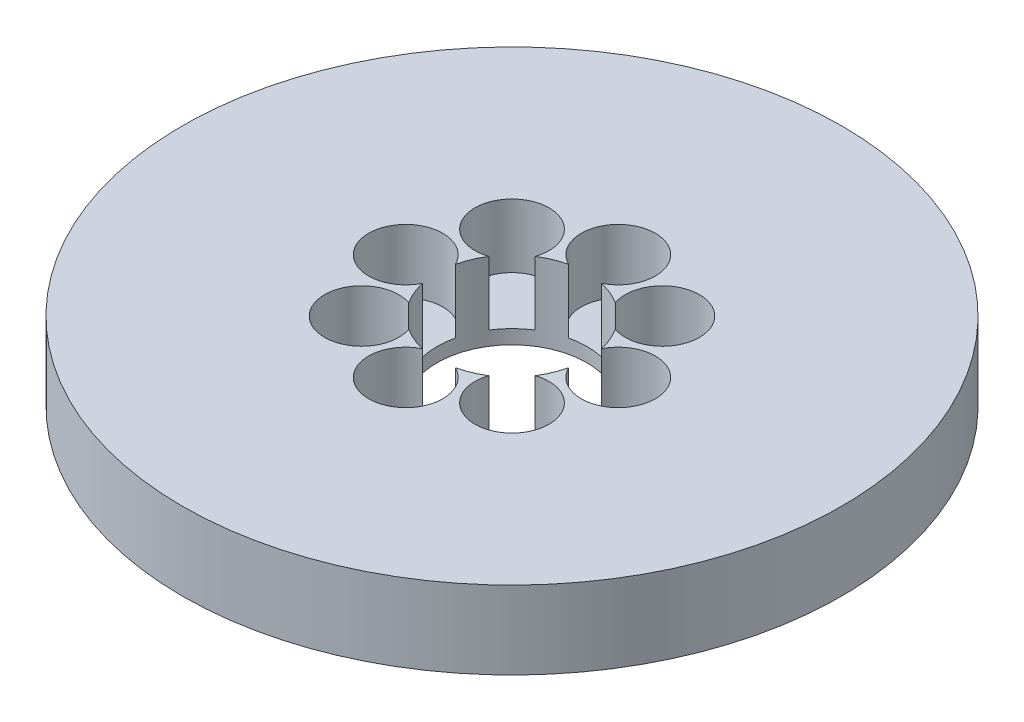
ISO-10303-21;
HEADER;
FILE_DESCRIPTION(('STEP AP214'),'2;1');
FILE_NAME('part.step','',(''),(''),'','','');
FILE_SCHEMA(('AUTOMOTIVE_DESIGN { 1 0 10303 214 1 1 1 1 }'));
ENDSEC;
DATA;
#1=APPLICATION_CONTEXT('core data for automotive mechanical design processes');
#2=APPLICATION_PROTOCOL_DEFINITION('international standard','automotive_design',2000,#1);
#3=PRODUCT_CONTEXT('',#1,'mechanical');
#4=PRODUCT('Part','Part','',(#3));
#5=PRODUCT_RELATED_PRODUCT_CATEGORY('part','',(#4));
#6=PRODUCT_DEFINITION_FORMATION('','',#4);
#7=PRODUCT_DEFINITION_CONTEXT('part definition',#1,'design');
#8=PRODUCT_DEFINITION('design','',#6,#7);
#9=PRODUCT_DEFINITION_SHAPE('','',#8);
#10=(LENGTH_UNIT() NAMED_UNIT(*) SI_UNIT(.MILLI.,.METRE.));
#11=(NAMED_UNIT(*) PLANE_ANGLE_UNIT() SI_UNIT($,.RADIAN.));
#12=(NAMED_UNIT(*) SI_UNIT($,.STERADIAN.) SOLID_ANGLE_UNIT());
#13=UNCERTAINTY_MEASURE_WITH_UNIT(LENGTH_MEASURE(1.E-05),#10,'distance_accuracy_value','');
#14=(GEOMETRIC_REPRESENTATION_CONTEXT(3) GLOBAL_UNCERTAINTY_ASSIGNED_CONTEXT((#13)) GLOBAL_UNIT_ASSIGNED_CONTEXT((#10,
#11,#12)) REPRESENTATION_CONTEXT('',''));
#15=CARTESIAN_POINT('',(0.,0.,0.));
#16=DIRECTION('',(0.,0.,1.));
#17=DIRECTION('',(1.,0.,0.));
#18=AXIS2_PLACEMENT_3D('',#15,#16,#17);
#19=CARTESIAN_POINT('',(0.,13.,0.));
#20=DIRECTION('',(0.,-1.,0.));
#21=DIRECTION('',(0.,0.,-1.));
#22=AXIS2_PLACEMENT_3D('',#19,#20,#21);
#23=CYLINDRICAL_SURFACE('',#22,55.);
#24=CARTESIAN_POINT('',(0.,13.,0.));
#25=DIRECTION('',(0.,1.,0.));
#26=DIRECTION('',(0.,0.,1.));
#27=AXIS2_PLACEMENT_3D('',#24,#25,#26);
#28=CIRCLE('',#27,55.);
#29=CARTESIAN_POINT('',(0.,13.,-55.));
#30=VERTEX_POINT('',#29);
#31=EDGE_CURVE('E195',#30,#30,#28,.T.);
#32=CARTESIAN_POINT('',(0.,0.,0.));
#33=DIRECTION('',(0.,1.,0.));
#34=DIRECTION('',(0.,0.,1.));
#35=AXIS2_PLACEMENT_3D('',#32,#33,#34);
#36=CIRCLE('',#35,55.);
#37=CARTESIAN_POINT('',(0.,0.,-55.));
#38=VERTEX_POINT('',#37);
#39=EDGE_CURVE('E179',#38,#38,#36,.T.);
#40=CARTESIAN_POINT('',(0.,13.,-55.));
#41=CARTESIAN_POINT('',(0.,12.8645833333333,-55.));
#42=CARTESIAN_POINT('',(0.,12.7291666666667,-55.));
#43=CARTESIAN_POINT('',(0.,12.4583333333333,-55.));
#44=CARTESIAN_POINT('',(0.,12.3229166666667,-55.));
#45=CARTESIAN_POINT('',(0.,12.0520833333333,-55.));
#46=CARTESIAN_POINT('',(0.,11.9166666666667,-55.));
#47=CARTESIAN_POINT('',(0.,11.6458333333333,-55.));
#48=CARTESIAN_POINT('',(0.,11.5104166666667,-55.));
#49=CARTESIAN_POINT('',(0.,11.2395833333333,-55.));
#50=CARTESIAN_POINT('',(0.,11.1041666666667,-55.));
#51=CARTESIAN_POINT('',(0.,10.8333333333333,-55.));
#52=CARTESIAN_POINT('',(0.,10.6979166666667,-55.));
#53=CARTESIAN_POINT('',(0.,10.4270833333333,-55.));
#54=CARTESIAN_POINT('',(0.,10.2916666666667,-55.));
#55=CARTESIAN_POINT('',(0.,10.0208333333333,-55.));
#56=CARTESIAN_POINT('',(0.,9.88541666666667,-55.));
#57=CARTESIAN_POINT('',(0.,9.61458333333333,-55.));
#58=CARTESIAN_POINT('',(0.,9.47916666666667,-55.));
#59=CARTESIAN_POINT('',(0.,9.20833333333333,-55.));
#60=CARTESIAN_POINT('',(0.,9.07291666666667,-55.));
#61=CARTESIAN_POINT('',(0.,8.80208333333333,-55.));
#62=CARTESIAN_POINT('',(0.,8.66666666666667,-55.));
#63=CARTESIAN_POINT('',(0.,8.39583333333333,-55.));
#64=CARTESIAN_POINT('',(0.,8.26041666666667,-55.));
#65=CARTESIAN_POINT('',(0.,7.98958333333333,-55.));
#66=CARTESIAN_POINT('',(0.,7.85416666666667,-55.));
#67=CARTESIAN_POINT('',(0.,7.58333333333333,-55.));
#68=CARTESIAN_POINT('',(0.,7.44791666666667,-55.));
#69=CARTESIAN_POINT('',(0.,7.17708333333333,-55.));
#70=CARTESIAN_POINT('',(0.,7.04166666666667,-55.));
#71=CARTESIAN_POINT('',(0.,6.77083333333333,-55.));
#72=CARTESIAN_POINT('',(0.,6.63541666666667,-55.));
#73=CARTESIAN_POINT('',(0.,6.36458333333333,-55.));
#74=CARTESIAN_POINT('',(0.,6.22916666666667,-55.));
#75=CARTESIAN_POINT('',(0.,5.95833333333333,-55.));
#76=CARTESIAN_POINT('',(0.,5.82291666666667,-55.));
#77=CARTESIAN_POINT('',(0.,5.55208333333333,-55.));
#78=CARTESIAN_POINT('',(0.,5.41666666666667,-55.));
#79=CARTESIAN_POINT('',(0.,5.14583333333333,-55.));
#80=CARTESIAN_POINT('',(0.,5.01041666666667,-55.));
#81=CARTESIAN_POINT('',(0.,4.73958333333333,-55.));
#82=CARTESIAN_POINT('',(0.,4.60416666666667,-55.));
#83=CARTESIAN_POINT('',(0.,4.33333333333333,-55.));
#84=CARTESIAN_POINT('',(0.,4.19791666666667,-55.));
#85=CARTESIAN_POINT('',(0.,3.92708333333333,-55.));
#86=CARTESIAN_POINT('',(0.,3.79166666666667,-55.));
#87=CARTESIAN_POINT('',(0.,3.52083333333333,-55.));
#88=CARTESIAN_POINT('',(0.,3.38541666666667,-55.));
#89=CARTESIAN_POINT('',(0.,3.11458333333333,-55.));
#90=CARTESIAN_POINT('',(0.,2.97916666666667,-55.));
#91=CARTESIAN_POINT('',(0.,2.70833333333333,-55.));
#92=CARTESIAN_POINT('',(0.,2.57291666666667,-55.));
#93=CARTESIAN_POINT('',(0.,2.30208333333333,-55.));
#94=CARTESIAN_POINT('',(0.,2.16666666666667,-55.));
#95=CARTESIAN_POINT('',(0.,1.89583333333333,-55.));
#96=CARTESIAN_POINT('',(0.,1.76041666666667,-55.));
#97=CARTESIAN_POINT('',(0.,1.48958333333333,-55.));
#98=CARTESIAN_POINT('',(0.,1.35416666666667,-55.));
#99=CARTESIAN_POINT('',(0.,1.08333333333333,-55.));
#100=CARTESIAN_POINT('',(0.,0.947916666666667,-55.));
#101=CARTESIAN_POINT('',(0.,0.677083333333334,-55.));
#102=CARTESIAN_POINT('',(0.,0.541666666666667,-55.));
#103=CARTESIAN_POINT('',(0.,0.270833333333334,-55.));
#104=CARTESIAN_POINT('',(0.,0.135416666666667,-55.));
#105=CARTESIAN_POINT('',(0.,0.,-55.));
#106=B_SPLINE_CURVE_WITH_KNOTS('',3,(#40,#41,#42,#43,#44,#45,#46,#47,#48,#49,#50,#51,#52,#53,
#54,#55,#56,#57,#58,#59,#60,#61,#62,#63,#64,#65,#66,#67,#68,#69,#70,#71,#72,#73,#74,#75,#76,#77,
#78,#79,#80,#81,#82,#83,#84,#85,#86,#87,#88,#89,#90,#91,#92,#93,#94,#95,#96,#97,#98,#99,#100,
#101,#102,#103,#104,#105),.UNSPECIFIED.,.F.,.F.,(4,2,2,2,2,2,2,2,2,2,2,2,2,2,2,2,2,2,2,2,2,2,2,
2,2,2,2,2,2,2,2,2,4),(0.,0.406249999999999,0.812499999999999,1.21875,1.625,2.03125,2.4375,
2.84375,3.25,3.65625,4.0625,4.46875,4.875,5.28125,5.6875,6.09375,6.5,6.90625,7.3125,7.71875,
8.125,8.53125,8.9375,9.34375,9.75,10.15625,10.5625,10.96875,11.375,11.78125,12.1875,12.59375,
13.),.UNSPECIFIED.);
#107=EDGE_CURVE('BSEAM39',#30,#38,#106,.T.);
#108=ORIENTED_EDGE('',*,*,#31,.F.);
#109=ORIENTED_EDGE('',*,*,#39,.T.);
#110=ORIENTED_EDGE('',*,*,#107,.T.);
#111=ORIENTED_EDGE('',*,*,#107,.F.);
#112=EDGE_LOOP('',(#108,#110,#109,#111));
#113=FACE_BOUND('',#112,.T.);
#114=ADVANCED_FACE('F39',(#113),#23,.T.);
#115=CARTESIAN_POINT('',(0.,13.,0.));
#116=DIRECTION('',(0.,1.,0.));
#117=DIRECTION('',(0.,0.,1.));
#118=AXIS2_PLACEMENT_3D('',#115,#116,#117);
#119=PLANE('',#118);
#120=CARTESIAN_POINT('',(0.,13.,17.7436626004451));
#121=DIRECTION('',(0.,1.,0.));
#122=DIRECTION('',(1.,0.,0.));
#123=AXIS2_PLACEMENT_3D('',#120,#121,#122);
#124=CIRCLE('',#123,6.18755834825898);
#125=CARTESIAN_POINT('',(-2.74021456123625,13.,12.1959511379141));
#126=VERTEX_POINT('',#125);
#127=CARTESIAN_POINT('',(2.74021456123633,13.,12.1959511379141));
#128=VERTEX_POINT('',#127);
#129=EDGE_CURVE('E176',#126,#128,#124,.T.);
#130=ORIENTED_EDGE('',*,*,#129,.F.);
#131=CARTESIAN_POINT('',(0.,13.,0.));
#132=DIRECTION('',(0.,1.,0.));
#133=DIRECTION('',(0.,0.,1.));
#134=AXIS2_PLACEMENT_3D('',#131,#132,#133);
#135=CIRCLE('',#134,12.5);
#136=CARTESIAN_POINT('',(-6.68621545448255,13.,10.5614640507952));
#137=VERTEX_POINT('',#136);
#138=EDGE_CURVE('E166',#137,#126,#135,.T.);
#139=ORIENTED_EDGE('',*,*,#138,.F.);
#140=CARTESIAN_POINT('',(-12.5466641478609,13.,12.5466641478609));
#141=DIRECTION('',(0.,1.,0.));
#142=DIRECTION('',(0.707106781186549,0.,0.707106781186546));
#143=AXIS2_PLACEMENT_3D('',#140,#141,#142);
#144=CIRCLE('',#143,6.18755834825898);
#145=CARTESIAN_POINT('',(-10.5614640507951,13.,6.68621545448259));
#146=VERTEX_POINT('',#145);
#147=EDGE_CURVE('E147',#146,#137,#144,.T.);
#148=ORIENTED_EDGE('',*,*,#147,.F.);
#149=CARTESIAN_POINT('',(-12.1959511379141,13.,2.74021456123629));
#150=VERTEX_POINT('',#149);
#151=EDGE_CURVE('E180',#150,#146,#135,.T.);
#152=ORIENTED_EDGE('',*,*,#151,.F.);
#153=CARTESIAN_POINT('',(-17.7436626004451,13.,0.));
#154=DIRECTION('',(0.,1.,0.));
#155=DIRECTION('',(0.,0.,1.));
#156=AXIS2_PLACEMENT_3D('',#153,#154,#155);
#157=CIRCLE('',#156,6.18755834825898);
#158=CARTESIAN_POINT('',(-12.1959511379141,13.,-2.74021456123629));
#159=VERTEX_POINT('',#158);
#160=EDGE_CURVE('E186',#159,#150,#157,.T.);
#161=ORIENTED_EDGE('',*,*,#160,.F.);
#162=CARTESIAN_POINT('',(-10.5614640507952,13.,-6.68621545448244));
#163=VERTEX_POINT('',#162);
#164=EDGE_CURVE('E182',#163,#159,#135,.T.);
#165=ORIENTED_EDGE('',*,*,#164,.F.);
#166=CARTESIAN_POINT('',(-12.546664147861,13.,-12.5466641478607));
#167=DIRECTION('',(0.,1.,0.));
#168=DIRECTION('',(-0.707106781186539,0.,0.707106781186556));
#169=AXIS2_PLACEMENT_3D('',#166,#167,#168);
#170=CIRCLE('',#169,6.18755834825898);
#171=CARTESIAN_POINT('',(-6.68621545448269,13.,-10.5614640507951));
#172=VERTEX_POINT('',#171);
#173=EDGE_CURVE('E446',#172,#163,#170,.T.);
#174=ORIENTED_EDGE('',*,*,#173,.F.);
#175=CARTESIAN_POINT('',(-2.74021456123642,13.,-12.1959511379141));
#176=VERTEX_POINT('',#175);
#177=EDGE_CURVE('E452',#176,#172,#135,.T.);
#178=ORIENTED_EDGE('',*,*,#177,.F.);
#179=CARTESIAN_POINT('',(-1.85855000556549E-13,13.,-17.7436626004451));
#180=DIRECTION('',(0.,1.,0.));
#181=DIRECTION('',(-1.,0.,0.));
#182=AXIS2_PLACEMENT_3D('',#179,#180,#181);
#183=CIRCLE('',#182,6.18755834825898);
#184=CARTESIAN_POINT('',(2.74021456123616,13.,-12.1959511379141));
#185=VERTEX_POINT('',#184);
#186=EDGE_CURVE('E477',#185,#176,#183,.T.);
#187=ORIENTED_EDGE('',*,*,#186,.F.);
#188=CARTESIAN_POINT('',(6.68621545448247,13.,-10.5614640507952));
#189=VERTEX_POINT('',#188);
#190=EDGE_CURVE('E460',#189,#185,#135,.T.);
#191=ORIENTED_EDGE('',*,*,#190,.F.);
#192=CARTESIAN_POINT('',(12.5466641478608,13.,-12.546664147861));
#193=DIRECTION('',(0.,1.,0.));
#194=DIRECTION('',(-0.707106781186554,0.,-0.707106781186541));
#195=AXIS2_PLACEMENT_3D('',#192,#193,#194);
#196=CIRCLE('',#195,6.18755834825898);
#197=CARTESIAN_POINT('',(10.5614640507951,13.,-6.68621545448266));
#198=VERTEX_POINT('',#197);
#199=EDGE_CURVE('E464',#198,#189,#196,.T.);
#200=ORIENTED_EDGE('',*,*,#199,.F.);
#201=CARTESIAN_POINT('',(12.1959511379141,13.,-2.74021456123629));
#202=VERTEX_POINT('',#201);
#203=EDGE_CURVE('E459',#202,#198,#135,.T.);
#204=ORIENTED_EDGE('',*,*,#203,.F.);
#205=CARTESIAN_POINT('',(17.7436626004451,13.,0.));
#206=DIRECTION('',(0.,1.,0.));
#207=DIRECTION('',(0.,0.,-1.));
#208=AXIS2_PLACEMENT_3D('',#205,#206,#207);
#209=CIRCLE('',#208,6.18755834825898);
#210=CARTESIAN_POINT('',(12.1959511379141,13.,2.74021456123629));
#211=VERTEX_POINT('',#210);
#212=EDGE_CURVE('E469',#211,#202,#209,.T.);
#213=ORIENTED_EDGE('',*,*,#212,.F.);
#214=CARTESIAN_POINT('',(10.5614640507952,13.,6.68621545448251));
#215=VERTEX_POINT('',#214);
#216=EDGE_CURVE('E181',#215,#211,#135,.T.);
#217=ORIENTED_EDGE('',*,*,#216,.F.);
#218=CARTESIAN_POINT('',(12.5466641478609,13.,12.5466641478608));
#219=DIRECTION('',(0.,1.,0.));
#220=DIRECTION('',(0.707106781186544,0.,-0.707106781186551));
#221=AXIS2_PLACEMENT_3D('',#218,#219,#220);
#222=CIRCLE('',#221,6.18755834825898);
#223=CARTESIAN_POINT('',(6.68621545448262,13.,10.5614640507951));
#224=VERTEX_POINT('',#223);
#225=EDGE_CURVE('E475',#224,#215,#222,.T.);
#226=ORIENTED_EDGE('',*,*,#225,.F.);
#227=EDGE_CURVE('E177',#128,#224,#135,.T.);
#228=ORIENTED_EDGE('',*,*,#227,.F.);
#229=EDGE_LOOP('',(#130,#139,#148,#152,#161,#165,#174,#178,#187,#191,#200,#204,#213,#217,#226,#228));
#230=FACE_BOUND('',#229,.T.);
#231=ORIENTED_EDGE('',*,*,#31,.T.);
#232=EDGE_LOOP('',(#231));
#233=FACE_BOUND('',#232,.T.);
#234=ADVANCED_FACE('F172',(#230,#233),#119,.T.);
#235=CARTESIAN_POINT('',(0.,0.,0.));
#236=DIRECTION('',(0.,1.,0.));
#237=DIRECTION('',(0.,0.,1.));
#238=AXIS2_PLACEMENT_3D('',#235,#236,#237);
#239=PLANE('',#238);
#240=CARTESIAN_POINT('',(0.,0.,0.));
#241=DIRECTION('',(0.,1.,0.));
#242=DIRECTION('',(0.,0.,1.));
#243=AXIS2_PLACEMENT_3D('',#240,#241,#242);
#244=CIRCLE('',#243,12.5);
#245=CARTESIAN_POINT('',(0.,0.,12.5));
#246=VERTEX_POINT('',#245);
#247=EDGE_CURVE('E187',#246,#246,#244,.T.);
#248=ORIENTED_EDGE('',*,*,#247,.T.);
#249=EDGE_LOOP('',(#248));
#250=FACE_BOUND('',#249,.T.);
#251=ORIENTED_EDGE('',*,*,#39,.F.);
#252=EDGE_LOOP('',(#251));
#253=FACE_BOUND('',#252,.T.);
#254=ADVANCED_FACE('F270',(#250,#253),#239,.F.);
#255=CARTESIAN_POINT('',(0.,13.,0.));
#256=DIRECTION('',(0.,-1.,0.));
#257=DIRECTION('',(0.,0.,-1.));
#258=AXIS2_PLACEMENT_3D('',#255,#256,#257);
#259=CYLINDRICAL_SURFACE('',#258,12.5);
#260=DIRECTION('',(0.,1.,0.));
#261=VECTOR('',#260,1.);
#262=CARTESIAN_POINT('',(-2.74021456123624,7.67589770467598,12.1959511379141));
#263=LINE('',#262,#261);
#264=CARTESIAN_POINT('',(-2.74021456123625,2.35179540935197,12.1959511379141));
#265=VERTEX_POINT('',#264);
#266=EDGE_CURVE('E11',#265,#126,#263,.T.);
#267=ORIENTED_EDGE('',*,*,#266,.F.);
#268=CARTESIAN_POINT('',(0.,2.35179540935197,0.));
#269=DIRECTION('',(0.,1.,0.));
#270=DIRECTION('',(0.,0.,1.));
#271=AXIS2_PLACEMENT_3D('',#268,#269,#270);
#272=CIRCLE('',#271,12.5);
#273=CARTESIAN_POINT('',(2.74021456123633,2.35179540935197,12.1959511379141));
#274=VERTEX_POINT('',#273);
#275=EDGE_CURVE('E250',#265,#274,#272,.T.);
#276=ORIENTED_EDGE('',*,*,#275,.T.);
#277=DIRECTION('',(0.,1.,0.));
#278=VECTOR('',#277,1.);
#279=CARTESIAN_POINT('',(2.74021456123633,7.67589770467598,12.1959511379141));
#280=LINE('',#279,#278);
#281=EDGE_CURVE('E46',#128,#274,#280,.F.);
#282=ORIENTED_EDGE('',*,*,#281,.F.);
#283=ORIENTED_EDGE('',*,*,#227,.T.);
#284=DIRECTION('',(0.,1.,0.));
#285=VECTOR('',#284,1.);
#286=CARTESIAN_POINT('',(6.68621545448262,7.67589770467598,10.5614640507951));
#287=LINE('',#286,#285);
#288=CARTESIAN_POINT('',(6.68621545448262,2.35179540935197,10.5614640507951));
#289=VERTEX_POINT('',#288);
#290=EDGE_CURVE('E244',#289,#224,#287,.T.);
#291=ORIENTED_EDGE('',*,*,#290,.F.);
#292=CARTESIAN_POINT('',(0.,2.35179540935197,0.));
#293=DIRECTION('',(0.,1.,0.));
#294=DIRECTION('',(0.,0.,1.));
#295=AXIS2_PLACEMENT_3D('',#292,#293,#294);
#296=CIRCLE('',#295,12.5);
#297=CARTESIAN_POINT('',(10.5614640507952,2.35179540935197,6.68621545448251));
#298=VERTEX_POINT('',#297);
#299=EDGE_CURVE('E238',#289,#298,#296,.T.);
#300=ORIENTED_EDGE('',*,*,#299,.T.);
#301=DIRECTION('',(0.,1.,0.));
#302=VECTOR('',#301,1.);
#303=CARTESIAN_POINT('',(10.5614640507952,7.67589770467598,6.68621545448251));
#304=LINE('',#303,#302);
#305=EDGE_CURVE('E242',#215,#298,#304,.F.);
#306=ORIENTED_EDGE('',*,*,#305,.F.);
#307=ORIENTED_EDGE('',*,*,#216,.T.);
#308=DIRECTION('',(0.,1.,0.));
#309=VECTOR('',#308,1.);
#310=CARTESIAN_POINT('',(12.1959511379141,7.67589770467598,2.74021456123629));
#311=LINE('',#310,#309);
#312=CARTESIAN_POINT('',(12.1959511379141,2.35179540935197,2.74021456123629));
#313=VERTEX_POINT('',#312);
#314=EDGE_CURVE('E236',#313,#211,#311,.T.);
#315=ORIENTED_EDGE('',*,*,#314,.F.);
#316=CARTESIAN_POINT('',(0.,2.35179540935197,0.));
#317=DIRECTION('',(0.,1.,0.));
#318=DIRECTION('',(0.,0.,1.));
#319=AXIS2_PLACEMENT_3D('',#316,#317,#318);
#320=CIRCLE('',#319,12.5);
#321=CARTESIAN_POINT('',(12.1959511379141,2.35179540935197,-2.74021456123629));
#322=VERTEX_POINT('',#321);
#323=EDGE_CURVE('E235',#313,#322,#320,.T.);
#324=ORIENTED_EDGE('',*,*,#323,.T.);
#325=DIRECTION('',(0.,1.,0.));
#326=VECTOR('',#325,1.);
#327=CARTESIAN_POINT('',(12.1959511379141,7.67589770467598,-2.74021456123629));
#328=LINE('',#327,#326);
#329=EDGE_CURVE('E234',#202,#322,#328,.F.);
#330=ORIENTED_EDGE('',*,*,#329,.F.);
#331=ORIENTED_EDGE('',*,*,#203,.T.);
#332=DIRECTION('',(0.,1.,0.));
#333=VECTOR('',#332,1.);
#334=CARTESIAN_POINT('',(10.5614640507951,7.67589770467598,-6.68621545448266));
#335=LINE('',#334,#333);
#336=CARTESIAN_POINT('',(10.5614640507951,2.35179540935197,-6.68621545448266));
#337=VERTEX_POINT('',#336);
#338=EDGE_CURVE('E229',#337,#198,#335,.T.);
#339=ORIENTED_EDGE('',*,*,#338,.F.);
#340=CARTESIAN_POINT('',(0.,2.35179540935197,0.));
#341=DIRECTION('',(0.,1.,0.));
#342=DIRECTION('',(0.,0.,1.));
#343=AXIS2_PLACEMENT_3D('',#340,#341,#342);
#344=CIRCLE('',#343,12.5);
#345=CARTESIAN_POINT('',(6.68621545448247,2.35179540935197,-10.5614640507952));
#346=VERTEX_POINT('',#345);
#347=EDGE_CURVE('E221',#337,#346,#344,.T.);
#348=ORIENTED_EDGE('',*,*,#347,.T.);
#349=DIRECTION('',(0.,1.,0.));
#350=VECTOR('',#349,1.);
#351=CARTESIAN_POINT('',(6.68621545448247,7.67589770467598,-10.5614640507952));
#352=LINE('',#351,#350);
#353=EDGE_CURVE('E230',#189,#346,#352,.F.);
#354=ORIENTED_EDGE('',*,*,#353,.F.);
#355=ORIENTED_EDGE('',*,*,#190,.T.);
#356=DIRECTION('',(0.,1.,0.));
#357=VECTOR('',#356,1.);
#358=CARTESIAN_POINT('',(2.74021456123616,7.67589770467598,-12.1959511379141));
#359=LINE('',#358,#357);
#360=CARTESIAN_POINT('',(2.74021456123616,2.35179540935197,-12.1959511379141));
#361=VERTEX_POINT('',#360);
#362=EDGE_CURVE('E225',#361,#185,#359,.T.);
#363=ORIENTED_EDGE('',*,*,#362,.F.);
#364=CARTESIAN_POINT('',(0.,2.35179540935197,0.));
#365=DIRECTION('',(0.,1.,0.));
#366=DIRECTION('',(0.,0.,1.));
#367=AXIS2_PLACEMENT_3D('',#364,#365,#366);
#368=CIRCLE('',#367,12.5);
#369=CARTESIAN_POINT('',(-2.74021456123642,2.35179540935197,-12.1959511379141));
#370=VERTEX_POINT('',#369);
#371=EDGE_CURVE('E216',#361,#370,#368,.T.);
#372=ORIENTED_EDGE('',*,*,#371,.T.);
#373=DIRECTION('',(0.,1.,0.));
#374=VECTOR('',#373,1.);
#375=CARTESIAN_POINT('',(-2.74021456123641,7.67589770467598,-12.1959511379141));
#376=LINE('',#375,#374);
#377=EDGE_CURVE('E218',#176,#370,#376,.F.);
#378=ORIENTED_EDGE('',*,*,#377,.F.);
#379=ORIENTED_EDGE('',*,*,#177,.T.);
#380=DIRECTION('',(0.,1.,0.));
#381=VECTOR('',#380,1.);
#382=CARTESIAN_POINT('',(-6.68621545448269,7.67589770467598,-10.5614640507951));
#383=LINE('',#382,#381);
#384=CARTESIAN_POINT('',(-6.68621545448269,2.35179540935197,-10.5614640507951));
#385=VERTEX_POINT('',#384);
#386=EDGE_CURVE('E212',#385,#172,#383,.T.);
#387=ORIENTED_EDGE('',*,*,#386,.F.);
#388=CARTESIAN_POINT('',(0.,2.35179540935197,0.));
#389=DIRECTION('',(0.,1.,0.));
#390=DIRECTION('',(0.,0.,1.));
#391=AXIS2_PLACEMENT_3D('',#388,#389,#390);
#392=CIRCLE('',#391,12.5);
#393=CARTESIAN_POINT('',(-10.5614640507952,2.35179540935197,-6.68621545448244));
#394=VERTEX_POINT('',#393);
#395=EDGE_CURVE('E208',#385,#394,#392,.T.);
#396=ORIENTED_EDGE('',*,*,#395,.T.);
#397=DIRECTION('',(0.,1.,0.));
#398=VECTOR('',#397,1.);
#399=CARTESIAN_POINT('',(-10.5614640507952,7.67589770467598,-6.68621545448244));
#400=LINE('',#399,#398);
#401=EDGE_CURVE('E211',#163,#394,#400,.F.);
#402=ORIENTED_EDGE('',*,*,#401,.F.);
#403=ORIENTED_EDGE('',*,*,#164,.T.);
#404=DIRECTION('',(0.,1.,0.));
#405=VECTOR('',#404,1.);
#406=CARTESIAN_POINT('',(-12.1959511379141,7.67589770467598,-2.74021456123629));
#407=LINE('',#406,#405);
#408=CARTESIAN_POINT('',(-12.1959511379141,2.35179540935197,-2.74021456123629));
#409=VERTEX_POINT('',#408);
#410=EDGE_CURVE('E201',#409,#159,#407,.T.);
#411=ORIENTED_EDGE('',*,*,#410,.F.);
#412=CARTESIAN_POINT('',(0.,2.35179540935197,0.));
#413=DIRECTION('',(0.,1.,0.));
#414=DIRECTION('',(0.,0.,1.));
#415=AXIS2_PLACEMENT_3D('',#412,#413,#414);
#416=CIRCLE('',#415,12.5);
#417=CARTESIAN_POINT('',(-12.1959511379141,2.35179540935197,2.74021456123629));
#418=VERTEX_POINT('',#417);
#419=EDGE_CURVE('E194',#409,#418,#416,.T.);
#420=ORIENTED_EDGE('',*,*,#419,.T.);
#421=DIRECTION('',(0.,1.,0.));
#422=VECTOR('',#421,1.);
#423=CARTESIAN_POINT('',(-12.1959511379141,7.67589770467598,2.74021456123629));
#424=LINE('',#423,#422);
#425=EDGE_CURVE('E199',#150,#418,#424,.F.);
#426=ORIENTED_EDGE('',*,*,#425,.F.);
#427=ORIENTED_EDGE('',*,*,#151,.T.);
#428=DIRECTION('',(0.,1.,0.));
#429=VECTOR('',#428,1.);
#430=CARTESIAN_POINT('',(-10.5614640507952,7.67589770467598,6.68621545448258));
#431=LINE('',#430,#429);
#432=CARTESIAN_POINT('',(-10.5614640507951,2.35179540935197,6.68621545448259));
#433=VERTEX_POINT('',#432);
#434=EDGE_CURVE('E160',#433,#146,#431,.T.);
#435=ORIENTED_EDGE('',*,*,#434,.F.);
#436=CARTESIAN_POINT('',(0.,2.35179540935197,0.));
#437=DIRECTION('',(0.,1.,0.));
#438=DIRECTION('',(0.,0.,1.));
#439=AXIS2_PLACEMENT_3D('',#436,#437,#438);
#440=CIRCLE('',#439,12.5);
#441=CARTESIAN_POINT('',(-6.68621545448255,2.35179540935197,10.5614640507952));
#442=VERTEX_POINT('',#441);
#443=EDGE_CURVE('E168',#433,#442,#440,.T.);
#444=ORIENTED_EDGE('',*,*,#443,.T.);
#445=DIRECTION('',(0.,1.,0.));
#446=VECTOR('',#445,1.);
#447=CARTESIAN_POINT('',(-6.68621545448255,7.67589770467598,10.5614640507952));
#448=LINE('',#447,#446);
#449=EDGE_CURVE('E152',#137,#442,#448,.F.);
#450=ORIENTED_EDGE('',*,*,#449,.F.);
#451=ORIENTED_EDGE('',*,*,#138,.T.);
#452=EDGE_LOOP('',(#267,#276,#282,#283,#291,#300,#306,#307,#315,#324,#330,#331,#339,#348,#354,
#355,#363,#372,#378,#379,#387,#396,#402,#403,#411,#420,#426,#427,#435,#444,#450,#451));
#453=FACE_BOUND('',#452,.T.);
#454=ORIENTED_EDGE('',*,*,#247,.F.);
#455=EDGE_LOOP('',(#454));
#456=FACE_BOUND('',#455,.T.);
#457=ADVANCED_FACE('F170',(#453,#456),#259,.F.);
#458=CARTESIAN_POINT('',(-17.7436626004451,2.35179540935197,0.));
#459=DIRECTION('',(0.,1.,0.));
#460=DIRECTION('',(0.,0.,1.));
#461=AXIS2_PLACEMENT_3D('',#458,#459,#460);
#462=CYLINDRICAL_SURFACE('',#461,6.18755834825898);
#463=ORIENTED_EDGE('',*,*,#410,.T.);
#464=ORIENTED_EDGE('',*,*,#160,.T.);
#465=ORIENTED_EDGE('',*,*,#425,.T.);
#466=CARTESIAN_POINT('',(-17.7436626004451,2.35179540935197,0.));
#467=DIRECTION('',(0.,1.,0.));
#468=DIRECTION('',(0.,0.,1.));
#469=AXIS2_PLACEMENT_3D('',#466,#467,#468);
#470=CIRCLE('',#469,6.18755834825898);
#471=EDGE_CURVE('E191',#409,#418,#470,.T.);
#472=ORIENTED_EDGE('',*,*,#471,.F.);
#473=EDGE_LOOP('',(#463,#464,#465,#472));
#474=FACE_BOUND('',#473,.T.);
#475=ADVANCED_FACE('F279',(#474),#462,.F.);
#476=CARTESIAN_POINT('',(-17.7436626004451,2.35179540935197,0.));
#477=DIRECTION('',(0.,1.,0.));
#478=DIRECTION('',(0.,0.,1.));
#479=AXIS2_PLACEMENT_3D('',#476,#477,#478);
#480=PLANE('',#479);
#481=ORIENTED_EDGE('',*,*,#471,.T.);
#482=ORIENTED_EDGE('',*,*,#419,.F.);
#483=EDGE_LOOP('',(#481,#482));
#484=FACE_BOUND('',#483,.T.);
#485=ADVANCED_FACE('F285',(#484),#480,.T.);
#486=CARTESIAN_POINT('',(-12.5466641478609,2.35179540935197,12.5466641478609));
#487=DIRECTION('',(0.,1.,0.));
#488=DIRECTION('',(0.,0.,1.));
#489=AXIS2_PLACEMENT_3D('',#486,#487,#488);
#490=CYLINDRICAL_SURFACE('',#489,6.18755834825898);
#491=ORIENTED_EDGE('',*,*,#434,.T.);
#492=ORIENTED_EDGE('',*,*,#147,.T.);
#493=ORIENTED_EDGE('',*,*,#449,.T.);
#494=CARTESIAN_POINT('',(-12.5466641478609,2.35179540935197,12.5466641478609));
#495=DIRECTION('',(0.,1.,0.));
#496=DIRECTION('',(0.707106781186549,0.,0.707106781186546));
#497=AXIS2_PLACEMENT_3D('',#494,#495,#496);
#498=CIRCLE('',#497,6.18755834825898);
#499=EDGE_CURVE('E165',#433,#442,#498,.T.);
#500=ORIENTED_EDGE('',*,*,#499,.F.);
#501=EDGE_LOOP('',(#491,#492,#493,#500));
#502=FACE_BOUND('',#501,.T.);
#503=ADVANCED_FACE('F155',(#502),#490,.F.);
#504=CARTESIAN_POINT('',(-12.5466641478609,2.35179540935197,12.5466641478609));
#505=DIRECTION('',(0.,1.,0.));
#506=DIRECTION('',(0.707106781186549,0.,0.707106781186546));
#507=AXIS2_PLACEMENT_3D('',#504,#505,#506);
#508=PLANE('',#507);
#509=ORIENTED_EDGE('',*,*,#499,.T.);
#510=ORIENTED_EDGE('',*,*,#443,.F.);
#511=EDGE_LOOP('',(#509,#510));
#512=FACE_BOUND('',#511,.T.);
#513=ADVANCED_FACE('F288',(#512),#508,.T.);
#514=CARTESIAN_POINT('',(-12.546664147861,2.35179540935197,-12.5466641478607));
#515=DIRECTION('',(0.,1.,0.));
#516=DIRECTION('',(0.,0.,1.));
#517=AXIS2_PLACEMENT_3D('',#514,#515,#516);
#518=CYLINDRICAL_SURFACE('',#517,6.18755834825898);
#519=ORIENTED_EDGE('',*,*,#386,.T.);
#520=ORIENTED_EDGE('',*,*,#173,.T.);
#521=ORIENTED_EDGE('',*,*,#401,.T.);
#522=CARTESIAN_POINT('',(-12.546664147861,2.35179540935197,-12.5466641478607));
#523=DIRECTION('',(0.,1.,0.));
#524=DIRECTION('',(-0.707106781186539,0.,0.707106781186556));
#525=AXIS2_PLACEMENT_3D('',#522,#523,#524);
#526=CIRCLE('',#525,6.18755834825898);
#527=EDGE_CURVE('E447',#385,#394,#526,.T.);
#528=ORIENTED_EDGE('',*,*,#527,.F.);
#529=EDGE_LOOP('',(#519,#520,#521,#528));
#530=FACE_BOUND('',#529,.T.);
#531=ADVANCED_FACE('F295',(#530),#518,.F.);
#532=CARTESIAN_POINT('',(-12.546664147861,2.35179540935197,-12.5466641478607));
#533=DIRECTION('',(0.,1.,0.));
#534=DIRECTION('',(-0.707106781186539,0.,0.707106781186556));
#535=AXIS2_PLACEMENT_3D('',#532,#533,#534);
#536=PLANE('',#535);
#537=ORIENTED_EDGE('',*,*,#527,.T.);
#538=ORIENTED_EDGE('',*,*,#395,.F.);
#539=EDGE_LOOP('',(#537,#538));
#540=FACE_BOUND('',#539,.T.);
#541=ADVANCED_FACE('F375',(#540),#536,.T.);
#542=CARTESIAN_POINT('',(-1.85855000556549E-13,2.35179540935197,-17.7436626004451));
#543=DIRECTION('',(0.,1.,0.));
#544=DIRECTION('',(0.,0.,1.));
#545=AXIS2_PLACEMENT_3D('',#542,#543,#544);
#546=CYLINDRICAL_SURFACE('',#545,6.18755834825898);
#547=ORIENTED_EDGE('',*,*,#362,.T.);
#548=ORIENTED_EDGE('',*,*,#186,.T.);
#549=ORIENTED_EDGE('',*,*,#377,.T.);
#550=CARTESIAN_POINT('',(-1.85855000556549E-13,2.35179540935197,-17.7436626004451));
#551=DIRECTION('',(0.,1.,0.));
#552=DIRECTION('',(-1.,0.,0.));
#553=AXIS2_PLACEMENT_3D('',#550,#551,#552);
#554=CIRCLE('',#553,6.18755834825898);
#555=EDGE_CURVE('E467',#361,#370,#554,.T.);
#556=ORIENTED_EDGE('',*,*,#555,.F.);
#557=EDGE_LOOP('',(#547,#548,#549,#556));
#558=FACE_BOUND('',#557,.T.);
#559=ADVANCED_FACE('F361',(#558),#546,.F.);
#560=CARTESIAN_POINT('',(-1.85855000556549E-13,2.35179540935197,-17.7436626004451));
#561=DIRECTION('',(0.,1.,0.));
#562=DIRECTION('',(-1.,0.,0.));
#563=AXIS2_PLACEMENT_3D('',#560,#561,#562);
#564=PLANE('',#563);
#565=ORIENTED_EDGE('',*,*,#555,.T.);
#566=ORIENTED_EDGE('',*,*,#371,.F.);
#567=EDGE_LOOP('',(#565,#566));
#568=FACE_BOUND('',#567,.T.);
#569=ADVANCED_FACE('F297',(#568),#564,.T.);
#570=CARTESIAN_POINT('',(12.5466641478608,2.35179540935197,-12.546664147861));
#571=DIRECTION('',(0.,1.,0.));
#572=DIRECTION('',(0.,0.,1.));
#573=AXIS2_PLACEMENT_3D('',#570,#571,#572);
#574=CYLINDRICAL_SURFACE('',#573,6.18755834825898);
#575=ORIENTED_EDGE('',*,*,#338,.T.);
#576=ORIENTED_EDGE('',*,*,#199,.T.);
#577=ORIENTED_EDGE('',*,*,#353,.T.);
#578=CARTESIAN_POINT('',(12.5466641478608,2.35179540935197,-12.546664147861));
#579=DIRECTION('',(0.,1.,0.));
#580=DIRECTION('',(-0.707106781186554,0.,-0.707106781186541));
#581=AXIS2_PLACEMENT_3D('',#578,#579,#580);
#582=CIRCLE('',#581,6.18755834825898);
#583=EDGE_CURVE('E470',#337,#346,#582,.T.);
#584=ORIENTED_EDGE('',*,*,#583,.F.);
#585=EDGE_LOOP('',(#575,#576,#577,#584));
#586=FACE_BOUND('',#585,.T.);
#587=ADVANCED_FACE('F294',(#586),#574,.F.);
#588=CARTESIAN_POINT('',(12.5466641478608,2.35179540935197,-12.546664147861));
#589=DIRECTION('',(0.,1.,0.));
#590=DIRECTION('',(-0.707106781186554,0.,-0.707106781186541));
#591=AXIS2_PLACEMENT_3D('',#588,#589,#590);
#592=PLANE('',#591);
#593=ORIENTED_EDGE('',*,*,#583,.T.);
#594=ORIENTED_EDGE('',*,*,#347,.F.);
#595=EDGE_LOOP('',(#593,#594));
#596=FACE_BOUND('',#595,.T.);
#597=ADVANCED_FACE('F300',(#596),#592,.T.);
#598=CARTESIAN_POINT('',(17.7436626004451,2.35179540935197,0.));
#599=DIRECTION('',(0.,1.,0.));
#600=DIRECTION('',(0.,0.,1.));
#601=AXIS2_PLACEMENT_3D('',#598,#599,#600);
#602=CYLINDRICAL_SURFACE('',#601,6.18755834825898);
#603=ORIENTED_EDGE('',*,*,#314,.T.);
#604=ORIENTED_EDGE('',*,*,#212,.T.);
#605=ORIENTED_EDGE('',*,*,#329,.T.);
#606=CARTESIAN_POINT('',(17.7436626004451,2.35179540935197,0.));
#607=DIRECTION('',(0.,1.,0.));
#608=DIRECTION('',(0.,0.,-1.));
#609=AXIS2_PLACEMENT_3D('',#606,#607,#608);
#610=CIRCLE('',#609,6.18755834825898);
#611=EDGE_CURVE('E472',#313,#322,#610,.T.);
#612=ORIENTED_EDGE('',*,*,#611,.F.);
#613=EDGE_LOOP('',(#603,#604,#605,#612));
#614=FACE_BOUND('',#613,.T.);
#615=ADVANCED_FACE('F305',(#614),#602,.F.);
#616=CARTESIAN_POINT('',(17.7436626004451,2.35179540935197,0.));
#617=DIRECTION('',(0.,1.,0.));
#618=DIRECTION('',(0.,0.,-1.));
#619=AXIS2_PLACEMENT_3D('',#616,#617,#618);
#620=PLANE('',#619);
#621=ORIENTED_EDGE('',*,*,#611,.T.);
#622=ORIENTED_EDGE('',*,*,#323,.F.);
#623=EDGE_LOOP('',(#621,#622));
#624=FACE_BOUND('',#623,.T.);
#625=ADVANCED_FACE('F308',(#624),#620,.T.);
#626=CARTESIAN_POINT('',(12.5466641478609,2.35179540935197,12.5466641478608));
#627=DIRECTION('',(0.,1.,0.));
#628=DIRECTION('',(0.,0.,1.));
#629=AXIS2_PLACEMENT_3D('',#626,#627,#628);
#630=CYLINDRICAL_SURFACE('',#629,6.18755834825898);
#631=ORIENTED_EDGE('',*,*,#290,.T.);
#632=ORIENTED_EDGE('',*,*,#225,.T.);
#633=ORIENTED_EDGE('',*,*,#305,.T.);
#634=CARTESIAN_POINT('',(12.5466641478609,2.35179540935197,12.5466641478608));
#635=DIRECTION('',(0.,1.,0.));
#636=DIRECTION('',(0.707106781186544,0.,-0.707106781186551));
#637=AXIS2_PLACEMENT_3D('',#634,#635,#636);
#638=CIRCLE('',#637,6.18755834825898);
#639=EDGE_CURVE('E56',#289,#298,#638,.T.);
#640=ORIENTED_EDGE('',*,*,#639,.F.);
#641=EDGE_LOOP('',(#631,#632,#633,#640));
#642=FACE_BOUND('',#641,.T.);
#643=ADVANCED_FACE('F309',(#642),#630,.F.);
#644=CARTESIAN_POINT('',(12.5466641478609,2.35179540935197,12.5466641478608));
#645=DIRECTION('',(0.,1.,0.));
#646=DIRECTION('',(0.707106781186544,0.,-0.707106781186551));
#647=AXIS2_PLACEMENT_3D('',#644,#645,#646);
#648=PLANE('',#647);
#649=ORIENTED_EDGE('',*,*,#639,.T.);
#650=ORIENTED_EDGE('',*,*,#299,.F.);
#651=EDGE_LOOP('',(#649,#650));
#652=FACE_BOUND('',#651,.T.);
#653=ADVANCED_FACE('F256',(#652),#648,.T.);
#654=CARTESIAN_POINT('',(0.,2.35179540935197,17.7436626004451));
#655=DIRECTION('',(0.,1.,0.));
#656=DIRECTION('',(0.,0.,1.));
#657=AXIS2_PLACEMENT_3D('',#654,#655,#656);
#658=CYLINDRICAL_SURFACE('',#657,6.18755834825898);
#659=ORIENTED_EDGE('',*,*,#266,.T.);
#660=ORIENTED_EDGE('',*,*,#129,.T.);
#661=ORIENTED_EDGE('',*,*,#281,.T.);
#662=CARTESIAN_POINT('',(0.,2.35179540935197,17.7436626004451));
#663=DIRECTION('',(0.,1.,0.));
#664=DIRECTION('',(1.,0.,0.));
#665=AXIS2_PLACEMENT_3D('',#662,#663,#664);
#666=CIRCLE('',#665,6.18755834825898);
#667=EDGE_CURVE('E55',#265,#274,#666,.T.);
#668=ORIENTED_EDGE('',*,*,#667,.F.);
#669=EDGE_LOOP('',(#659,#660,#661,#668));
#670=FACE_BOUND('',#669,.T.);
#671=ADVANCED_FACE('F253',(#670),#658,.F.);
#672=CARTESIAN_POINT('',(0.,2.35179540935197,17.7436626004451));
#673=DIRECTION('',(0.,1.,0.));
#674=DIRECTION('',(1.,0.,0.));
#675=AXIS2_PLACEMENT_3D('',#672,#673,#674);
#676=PLANE('',#675);
#677=ORIENTED_EDGE('',*,*,#667,.T.);
#678=ORIENTED_EDGE('',*,*,#275,.F.);
#679=EDGE_LOOP('',(#677,#678));
#680=FACE_BOUND('',#679,.T.);
#681=ADVANCED_FACE('F252',(#680),#676,.T.);
#682=CLOSED_SHELL('',(#114,#234,#254,#457,#475,#485,#503,#513,#531,#541,#559,#569,#587,#597,
#615,#625,#643,#653,#671,#681));
#683=MANIFOLD_SOLID_BREP('B2',#682);
#684=ADVANCED_BREP_SHAPE_REPRESENTATION('',(#18,#683),#14);
#685=SHAPE_DEFINITION_REPRESENTATION(#9,#684);
ENDSEC;
END-ISO-10303-21;
